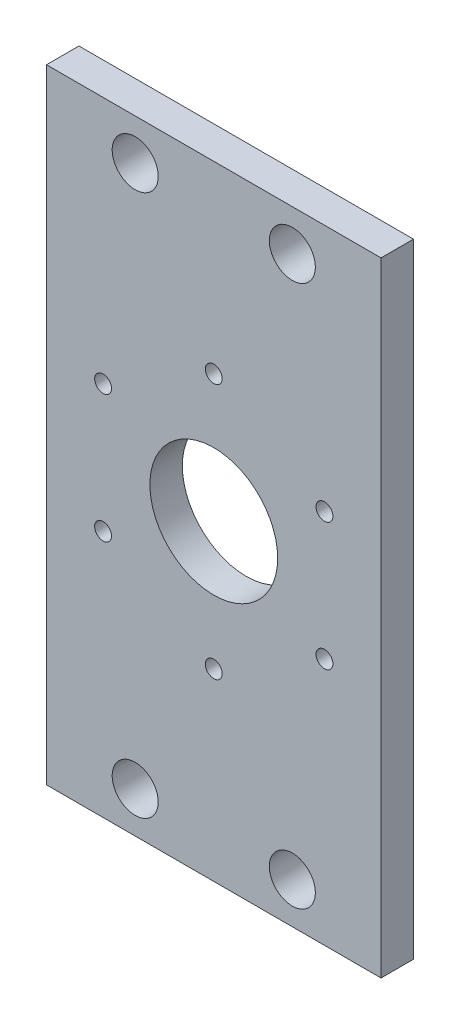
ISO-10303-21;
HEADER;
FILE_DESCRIPTION(('STEP AP214'),'2;1');
FILE_NAME('part.step','',(''),(''),'','','');
FILE_SCHEMA(('AUTOMOTIVE_DESIGN { 1 0 10303 214 1 1 1 1 }'));
ENDSEC;
DATA;
#1=APPLICATION_CONTEXT('core data for automotive mechanical design processes');
#2=APPLICATION_PROTOCOL_DEFINITION('international standard','automotive_design',2000,#1);
#3=PRODUCT_CONTEXT('',#1,'mechanical');
#4=PRODUCT('Part','Part','',(#3));
#5=PRODUCT_RELATED_PRODUCT_CATEGORY('part','',(#4));
#6=PRODUCT_DEFINITION_FORMATION('','',#4);
#7=PRODUCT_DEFINITION_CONTEXT('part definition',#1,'design');
#8=PRODUCT_DEFINITION('design','',#6,#7);
#9=PRODUCT_DEFINITION_SHAPE('','',#8);
#10=(LENGTH_UNIT() NAMED_UNIT(*) SI_UNIT(.MILLI.,.METRE.));
#11=(NAMED_UNIT(*) PLANE_ANGLE_UNIT() SI_UNIT($,.RADIAN.));
#12=(NAMED_UNIT(*) SI_UNIT($,.STERADIAN.) SOLID_ANGLE_UNIT());
#13=UNCERTAINTY_MEASURE_WITH_UNIT(LENGTH_MEASURE(1.E-05),#10,'distance_accuracy_value','');
#14=(GEOMETRIC_REPRESENTATION_CONTEXT(3) GLOBAL_UNCERTAINTY_ASSIGNED_CONTEXT((#13)) GLOBAL_UNIT_ASSIGNED_CONTEXT((#10,
#11,#12)) REPRESENTATION_CONTEXT('',''));
#15=CARTESIAN_POINT('',(0.,0.,0.));
#16=DIRECTION('',(0.,0.,1.));
#17=DIRECTION('',(1.,0.,0.));
#18=AXIS2_PLACEMENT_3D('',#15,#16,#17);
#19=CARTESIAN_POINT('',(0.,0.,6.35));
#20=DIRECTION('',(0.,0.,-1.));
#21=DIRECTION('',(-1.,0.,0.));
#22=AXIS2_PLACEMENT_3D('',#19,#20,#21);
#23=PLANE('',#22);
#24=CARTESIAN_POINT('',(0.,0.,6.35));
#25=DIRECTION('',(0.,0.,1.));
#26=DIRECTION('',(1.,0.,0.));
#27=AXIS2_PLACEMENT_3D('',#24,#25,#26);
#28=CIRCLE('',#27,12.5);
#29=CARTESIAN_POINT('',(12.5,0.,6.35));
#30=VERTEX_POINT('',#29);
#31=EDGE_CURVE('E175',#30,#30,#28,.T.);
#32=ORIENTED_EDGE('',*,*,#31,.F.);
#33=EDGE_LOOP('',(#32));
#34=FACE_BOUND('',#33,.T.);
#35=CARTESIAN_POINT('',(-15.37,53.,6.35));
#36=DIRECTION('',(0.,0.,1.));
#37=DIRECTION('',(1.,0.,0.));
#38=AXIS2_PLACEMENT_3D('',#35,#36,#37);
#39=CIRCLE('',#38,4.5);
#40=CARTESIAN_POINT('',(-10.87,53.,6.35));
#41=VERTEX_POINT('',#40);
#42=EDGE_CURVE('E172',#41,#41,#39,.T.);
#43=ORIENTED_EDGE('',*,*,#42,.F.);
#44=EDGE_LOOP('',(#43));
#45=FACE_BOUND('',#44,.T.);
#46=CARTESIAN_POINT('',(15.37,53.,6.35));
#47=DIRECTION('',(0.,0.,1.));
#48=DIRECTION('',(1.,0.,0.));
#49=AXIS2_PLACEMENT_3D('',#46,#47,#48);
#50=CIRCLE('',#49,4.5);
#51=CARTESIAN_POINT('',(19.87,53.,6.35));
#52=VERTEX_POINT('',#51);
#53=EDGE_CURVE('E166',#52,#52,#50,.T.);
#54=ORIENTED_EDGE('',*,*,#53,.F.);
#55=EDGE_LOOP('',(#54));
#56=FACE_BOUND('',#55,.T.);
#57=CARTESIAN_POINT('',(-15.37,-53.,6.35));
#58=DIRECTION('',(0.,0.,1.));
#59=DIRECTION('',(1.,0.,0.));
#60=AXIS2_PLACEMENT_3D('',#57,#58,#59);
#61=CIRCLE('',#60,4.5);
#62=CARTESIAN_POINT('',(-10.87,-53.,6.35));
#63=VERTEX_POINT('',#62);
#64=EDGE_CURVE('E154',#63,#63,#61,.T.);
#65=ORIENTED_EDGE('',*,*,#64,.F.);
#66=EDGE_LOOP('',(#65));
#67=FACE_BOUND('',#66,.T.);
#68=CARTESIAN_POINT('',(0.,25.,6.35));
#69=DIRECTION('',(0.,0.,1.));
#70=DIRECTION('',(1.,0.,0.));
#71=AXIS2_PLACEMENT_3D('',#68,#69,#70);
#72=CIRCLE('',#71,1.64999999999999);
#73=CARTESIAN_POINT('',(1.64999999999999,25.,6.35));
#74=VERTEX_POINT('',#73);
#75=EDGE_CURVE('E148',#74,#74,#72,.T.);
#76=ORIENTED_EDGE('',*,*,#75,.F.);
#77=EDGE_LOOP('',(#76));
#78=FACE_BOUND('',#77,.T.);
#79=CARTESIAN_POINT('',(0.,-25.,6.35));
#80=DIRECTION('',(0.,0.,1.));
#81=DIRECTION('',(1.,0.,0.));
#82=AXIS2_PLACEMENT_3D('',#79,#80,#81);
#83=CIRCLE('',#82,1.64999999999999);
#84=CARTESIAN_POINT('',(1.64999999999999,-25.,6.35));
#85=VERTEX_POINT('',#84);
#86=EDGE_CURVE('E130',#85,#85,#83,.T.);
#87=ORIENTED_EDGE('',*,*,#86,.F.);
#88=EDGE_LOOP('',(#87));
#89=FACE_BOUND('',#88,.T.);
#90=CARTESIAN_POINT('',(21.650635094611,-12.5,6.35));
#91=DIRECTION('',(0.,0.,1.));
#92=DIRECTION('',(1.,0.,0.));
#93=AXIS2_PLACEMENT_3D('',#90,#91,#92);
#94=CIRCLE('',#93,1.64999999999999);
#95=CARTESIAN_POINT('',(23.300635094611,-12.5,6.35));
#96=VERTEX_POINT('',#95);
#97=EDGE_CURVE('E124',#96,#96,#94,.T.);
#98=ORIENTED_EDGE('',*,*,#97,.F.);
#99=EDGE_LOOP('',(#98));
#100=FACE_BOUND('',#99,.T.);
#101=CARTESIAN_POINT('',(21.650635094611,12.5,6.35));
#102=DIRECTION('',(0.,0.,1.));
#103=DIRECTION('',(1.,0.,0.));
#104=AXIS2_PLACEMENT_3D('',#101,#102,#103);
#105=CIRCLE('',#104,1.64999999999999);
#106=CARTESIAN_POINT('',(23.3006350946109,12.5,6.35));
#107=VERTEX_POINT('',#106);
#108=EDGE_CURVE('E118',#107,#107,#105,.T.);
#109=ORIENTED_EDGE('',*,*,#108,.F.);
#110=EDGE_LOOP('',(#109));
#111=FACE_BOUND('',#110,.T.);
#112=DIRECTION('',(0.,1.,0.));
#113=VECTOR('',#112,1.);
#114=CARTESIAN_POINT('',(32.72,-61.,6.35));
#115=LINE('',#114,#113);
#116=CARTESIAN_POINT('',(32.72,-61.,6.35));
#117=VERTEX_POINT('',#116);
#118=CARTESIAN_POINT('',(32.72,61.,6.35));
#119=VERTEX_POINT('',#118);
#120=EDGE_CURVE('E90',#117,#119,#115,.T.);
#121=ORIENTED_EDGE('',*,*,#120,.T.);
#122=DIRECTION('',(-1.,0.,0.));
#123=VECTOR('',#122,1.);
#124=CARTESIAN_POINT('',(-32.72,61.,6.35));
#125=LINE('',#124,#123);
#126=CARTESIAN_POINT('',(-32.72,61.,6.35));
#127=VERTEX_POINT('',#126);
#128=EDGE_CURVE('E85',#119,#127,#125,.T.);
#129=ORIENTED_EDGE('',*,*,#128,.T.);
#130=DIRECTION('',(0.,-1.,0.));
#131=VECTOR('',#130,1.);
#132=CARTESIAN_POINT('',(-32.72,-61.,6.35));
#133=LINE('',#132,#131);
#134=CARTESIAN_POINT('',(-32.72,-61.,6.35));
#135=VERTEX_POINT('',#134);
#136=EDGE_CURVE('E88',#127,#135,#133,.T.);
#137=ORIENTED_EDGE('',*,*,#136,.T.);
#138=DIRECTION('',(1.,0.,0.));
#139=VECTOR('',#138,1.);
#140=CARTESIAN_POINT('',(-32.72,-61.,6.35));
#141=LINE('',#140,#139);
#142=EDGE_CURVE('E55',#135,#117,#141,.T.);
#143=ORIENTED_EDGE('',*,*,#142,.T.);
#144=EDGE_LOOP('',(#121,#129,#137,#143));
#145=FACE_BOUND('',#144,.T.);
#146=CARTESIAN_POINT('',(-21.650635094611,-12.5,6.35));
#147=DIRECTION('',(0.,0.,1.));
#148=DIRECTION('',(1.,0.,0.));
#149=AXIS2_PLACEMENT_3D('',#146,#147,#148);
#150=CIRCLE('',#149,1.64999999999999);
#151=CARTESIAN_POINT('',(-20.000635094611,-12.5,6.35));
#152=VERTEX_POINT('',#151);
#153=EDGE_CURVE('E136',#152,#152,#150,.T.);
#154=ORIENTED_EDGE('',*,*,#153,.F.);
#155=EDGE_LOOP('',(#154));
#156=FACE_BOUND('',#155,.T.);
#157=CARTESIAN_POINT('',(-21.650635094611,12.5,6.35));
#158=DIRECTION('',(0.,0.,1.));
#159=DIRECTION('',(1.,0.,0.));
#160=AXIS2_PLACEMENT_3D('',#157,#158,#159);
#161=CIRCLE('',#160,1.64999999999999);
#162=CARTESIAN_POINT('',(-20.000635094611,12.5,6.35));
#163=VERTEX_POINT('',#162);
#164=EDGE_CURVE('E142',#163,#163,#161,.T.);
#165=ORIENTED_EDGE('',*,*,#164,.F.);
#166=EDGE_LOOP('',(#165));
#167=FACE_BOUND('',#166,.T.);
#168=CARTESIAN_POINT('',(15.37,-53.,6.35));
#169=DIRECTION('',(0.,0.,1.));
#170=DIRECTION('',(1.,0.,0.));
#171=AXIS2_PLACEMENT_3D('',#168,#169,#170);
#172=CIRCLE('',#171,4.5);
#173=CARTESIAN_POINT('',(19.87,-53.,6.35));
#174=VERTEX_POINT('',#173);
#175=EDGE_CURVE('E160',#174,#174,#172,.T.);
#176=ORIENTED_EDGE('',*,*,#175,.F.);
#177=EDGE_LOOP('',(#176));
#178=FACE_BOUND('',#177,.T.);
#179=ADVANCED_FACE('F38',(#34,#45,#56,#67,#78,#89,#100,#111,#145,#156,#167,#178),#23,.F.);
#180=CARTESIAN_POINT('',(32.72,-61.,6.35));
#181=DIRECTION('',(-1.,0.,0.));
#182=DIRECTION('',(0.,0.,1.));
#183=AXIS2_PLACEMENT_3D('',#180,#181,#182);
#184=PLANE('',#183);
#185=DIRECTION('',(0.,1.,0.));
#186=VECTOR('',#185,1.);
#187=CARTESIAN_POINT('',(32.72,-61.,0.));
#188=LINE('',#187,#186);
#189=CARTESIAN_POINT('',(32.72,-61.,0.));
#190=VERTEX_POINT('',#189);
#191=CARTESIAN_POINT('',(32.72,61.,0.));
#192=VERTEX_POINT('',#191);
#193=EDGE_CURVE('E102',#190,#192,#188,.T.);
#194=ORIENTED_EDGE('',*,*,#193,.T.);
#195=DIRECTION('',(0.,0.,-1.));
#196=VECTOR('',#195,1.);
#197=CARTESIAN_POINT('',(32.72,61.,6.35));
#198=LINE('',#197,#196);
#199=EDGE_CURVE('E11',#119,#192,#198,.T.);
#200=ORIENTED_EDGE('',*,*,#199,.F.);
#201=ORIENTED_EDGE('',*,*,#120,.F.);
#202=DIRECTION('',(0.,0.,-1.));
#203=VECTOR('',#202,1.);
#204=CARTESIAN_POINT('',(32.72,-61.,6.35));
#205=LINE('',#204,#203);
#206=EDGE_CURVE('E98',#117,#190,#205,.T.);
#207=ORIENTED_EDGE('',*,*,#206,.T.);
#208=EDGE_LOOP('',(#194,#200,#201,#207));
#209=FACE_BOUND('',#208,.T.);
#210=ADVANCED_FACE('F40',(#209),#184,.F.);
#211=CARTESIAN_POINT('',(-32.72,61.,6.35));
#212=DIRECTION('',(0.,-1.,0.));
#213=DIRECTION('',(0.,0.,-1.));
#214=AXIS2_PLACEMENT_3D('',#211,#212,#213);
#215=PLANE('',#214);
#216=DIRECTION('',(-1.,0.,0.));
#217=VECTOR('',#216,1.);
#218=CARTESIAN_POINT('',(-32.72,61.,0.));
#219=LINE('',#218,#217);
#220=CARTESIAN_POINT('',(-32.72,61.,0.));
#221=VERTEX_POINT('',#220);
#222=EDGE_CURVE('E94',#192,#221,#219,.T.);
#223=ORIENTED_EDGE('',*,*,#222,.T.);
#224=DIRECTION('',(0.,0.,-1.));
#225=VECTOR('',#224,1.);
#226=CARTESIAN_POINT('',(-32.72,61.,6.35));
#227=LINE('',#226,#225);
#228=EDGE_CURVE('E47',#127,#221,#227,.T.);
#229=ORIENTED_EDGE('',*,*,#228,.F.);
#230=ORIENTED_EDGE('',*,*,#128,.F.);
#231=ORIENTED_EDGE('',*,*,#199,.T.);
#232=EDGE_LOOP('',(#223,#229,#230,#231));
#233=FACE_BOUND('',#232,.T.);
#234=ADVANCED_FACE('F93',(#233),#215,.F.);
#235=CARTESIAN_POINT('',(-32.72,-61.,6.35));
#236=DIRECTION('',(1.,0.,0.));
#237=DIRECTION('',(0.,0.,-1.));
#238=AXIS2_PLACEMENT_3D('',#235,#236,#237);
#239=PLANE('',#238);
#240=DIRECTION('',(0.,-1.,0.));
#241=VECTOR('',#240,1.);
#242=CARTESIAN_POINT('',(-32.72,-61.,0.));
#243=LINE('',#242,#241);
#244=CARTESIAN_POINT('',(-32.72,-61.,0.));
#245=VERTEX_POINT('',#244);
#246=EDGE_CURVE('E72',#221,#245,#243,.T.);
#247=ORIENTED_EDGE('',*,*,#246,.T.);
#248=DIRECTION('',(0.,0.,-1.));
#249=VECTOR('',#248,1.);
#250=CARTESIAN_POINT('',(-32.72,-61.,6.35));
#251=LINE('',#250,#249);
#252=EDGE_CURVE('E95',#135,#245,#251,.T.);
#253=ORIENTED_EDGE('',*,*,#252,.F.);
#254=ORIENTED_EDGE('',*,*,#136,.F.);
#255=ORIENTED_EDGE('',*,*,#228,.T.);
#256=EDGE_LOOP('',(#247,#253,#254,#255));
#257=FACE_BOUND('',#256,.T.);
#258=ADVANCED_FACE('F96',(#257),#239,.F.);
#259=CARTESIAN_POINT('',(-32.72,-61.,6.35));
#260=DIRECTION('',(0.,1.,0.));
#261=DIRECTION('',(0.,0.,1.));
#262=AXIS2_PLACEMENT_3D('',#259,#260,#261);
#263=PLANE('',#262);
#264=DIRECTION('',(1.,0.,0.));
#265=VECTOR('',#264,1.);
#266=CARTESIAN_POINT('',(-32.72,-61.,0.));
#267=LINE('',#266,#265);
#268=EDGE_CURVE('E78',#245,#190,#267,.T.);
#269=ORIENTED_EDGE('',*,*,#268,.T.);
#270=ORIENTED_EDGE('',*,*,#206,.F.);
#271=ORIENTED_EDGE('',*,*,#142,.F.);
#272=ORIENTED_EDGE('',*,*,#252,.T.);
#273=EDGE_LOOP('',(#269,#270,#271,#272));
#274=FACE_BOUND('',#273,.T.);
#275=ADVANCED_FACE('F110',(#274),#263,.F.);
#276=CARTESIAN_POINT('',(0.,0.,0.));
#277=DIRECTION('',(0.,0.,-1.));
#278=DIRECTION('',(-1.,0.,0.));
#279=AXIS2_PLACEMENT_3D('',#276,#277,#278);
#280=PLANE('',#279);
#281=CARTESIAN_POINT('',(0.,0.,0.));
#282=DIRECTION('',(0.,0.,-1.));
#283=DIRECTION('',(-1.,0.,0.));
#284=AXIS2_PLACEMENT_3D('',#281,#282,#283);
#285=CIRCLE('',#284,12.5);
#286=CARTESIAN_POINT('',(-12.5,0.,0.));
#287=VERTEX_POINT('',#286);
#288=EDGE_CURVE('E176',#287,#287,#285,.F.);
#289=ORIENTED_EDGE('',*,*,#288,.T.);
#290=EDGE_LOOP('',(#289));
#291=FACE_BOUND('',#290,.T.);
#292=CARTESIAN_POINT('',(-15.37,53.,0.));
#293=DIRECTION('',(0.,0.,-1.));
#294=DIRECTION('',(-1.,0.,0.));
#295=AXIS2_PLACEMENT_3D('',#292,#293,#294);
#296=CIRCLE('',#295,4.5);
#297=CARTESIAN_POINT('',(-19.87,53.,0.));
#298=VERTEX_POINT('',#297);
#299=EDGE_CURVE('E169',#298,#298,#296,.T.);
#300=ORIENTED_EDGE('',*,*,#299,.F.);
#301=EDGE_LOOP('',(#300));
#302=FACE_BOUND('',#301,.T.);
#303=CARTESIAN_POINT('',(15.37,53.,0.));
#304=DIRECTION('',(0.,0.,-1.));
#305=DIRECTION('',(-1.,0.,0.));
#306=AXIS2_PLACEMENT_3D('',#303,#304,#305);
#307=CIRCLE('',#306,4.5);
#308=CARTESIAN_POINT('',(10.87,53.,0.));
#309=VERTEX_POINT('',#308);
#310=EDGE_CURVE('E163',#309,#309,#307,.T.);
#311=ORIENTED_EDGE('',*,*,#310,.F.);
#312=EDGE_LOOP('',(#311));
#313=FACE_BOUND('',#312,.T.);
#314=CARTESIAN_POINT('',(15.37,-53.,0.));
#315=DIRECTION('',(0.,0.,-1.));
#316=DIRECTION('',(-1.,0.,0.));
#317=AXIS2_PLACEMENT_3D('',#314,#315,#316);
#318=CIRCLE('',#317,4.5);
#319=CARTESIAN_POINT('',(10.87,-53.,0.));
#320=VERTEX_POINT('',#319);
#321=EDGE_CURVE('E157',#320,#320,#318,.T.);
#322=ORIENTED_EDGE('',*,*,#321,.F.);
#323=EDGE_LOOP('',(#322));
#324=FACE_BOUND('',#323,.T.);
#325=CARTESIAN_POINT('',(-15.37,-53.,0.));
#326=DIRECTION('',(0.,0.,-1.));
#327=DIRECTION('',(-1.,0.,0.));
#328=AXIS2_PLACEMENT_3D('',#325,#326,#327);
#329=CIRCLE('',#328,4.5);
#330=CARTESIAN_POINT('',(-19.87,-53.,0.));
#331=VERTEX_POINT('',#330);
#332=EDGE_CURVE('E151',#331,#331,#329,.T.);
#333=ORIENTED_EDGE('',*,*,#332,.F.);
#334=EDGE_LOOP('',(#333));
#335=FACE_BOUND('',#334,.T.);
#336=CARTESIAN_POINT('',(0.,25.,0.));
#337=DIRECTION('',(0.,0.,-1.));
#338=DIRECTION('',(-1.,0.,0.));
#339=AXIS2_PLACEMENT_3D('',#336,#337,#338);
#340=CIRCLE('',#339,1.64999999999999);
#341=CARTESIAN_POINT('',(-1.64999999999999,25.,0.));
#342=VERTEX_POINT('',#341);
#343=EDGE_CURVE('E145',#342,#342,#340,.T.);
#344=ORIENTED_EDGE('',*,*,#343,.F.);
#345=EDGE_LOOP('',(#344));
#346=FACE_BOUND('',#345,.T.);
#347=CARTESIAN_POINT('',(-21.650635094611,12.5,0.));
#348=DIRECTION('',(0.,0.,-1.));
#349=DIRECTION('',(-1.,0.,0.));
#350=AXIS2_PLACEMENT_3D('',#347,#348,#349);
#351=CIRCLE('',#350,1.64999999999999);
#352=CARTESIAN_POINT('',(-23.3006350946109,12.5,0.));
#353=VERTEX_POINT('',#352);
#354=EDGE_CURVE('E139',#353,#353,#351,.T.);
#355=ORIENTED_EDGE('',*,*,#354,.F.);
#356=EDGE_LOOP('',(#355));
#357=FACE_BOUND('',#356,.T.);
#358=CARTESIAN_POINT('',(-21.650635094611,-12.5,0.));
#359=DIRECTION('',(0.,0.,-1.));
#360=DIRECTION('',(-1.,0.,0.));
#361=AXIS2_PLACEMENT_3D('',#358,#359,#360);
#362=CIRCLE('',#361,1.64999999999999);
#363=CARTESIAN_POINT('',(-23.300635094611,-12.5,0.));
#364=VERTEX_POINT('',#363);
#365=EDGE_CURVE('E133',#364,#364,#362,.T.);
#366=ORIENTED_EDGE('',*,*,#365,.F.);
#367=EDGE_LOOP('',(#366));
#368=FACE_BOUND('',#367,.T.);
#369=CARTESIAN_POINT('',(0.,-25.,0.));
#370=DIRECTION('',(0.,0.,-1.));
#371=DIRECTION('',(-1.,0.,0.));
#372=AXIS2_PLACEMENT_3D('',#369,#370,#371);
#373=CIRCLE('',#372,1.64999999999999);
#374=CARTESIAN_POINT('',(-1.64999999999999,-25.,0.));
#375=VERTEX_POINT('',#374);
#376=EDGE_CURVE('E127',#375,#375,#373,.T.);
#377=ORIENTED_EDGE('',*,*,#376,.F.);
#378=EDGE_LOOP('',(#377));
#379=FACE_BOUND('',#378,.T.);
#380=CARTESIAN_POINT('',(21.650635094611,-12.5,0.));
#381=DIRECTION('',(0.,0.,-1.));
#382=DIRECTION('',(-1.,0.,0.));
#383=AXIS2_PLACEMENT_3D('',#380,#381,#382);
#384=CIRCLE('',#383,1.64999999999999);
#385=CARTESIAN_POINT('',(20.000635094611,-12.5,0.));
#386=VERTEX_POINT('',#385);
#387=EDGE_CURVE('E121',#386,#386,#384,.T.);
#388=ORIENTED_EDGE('',*,*,#387,.F.);
#389=EDGE_LOOP('',(#388));
#390=FACE_BOUND('',#389,.T.);
#391=CARTESIAN_POINT('',(21.650635094611,12.5,0.));
#392=DIRECTION('',(0.,0.,-1.));
#393=DIRECTION('',(-1.,0.,0.));
#394=AXIS2_PLACEMENT_3D('',#391,#392,#393);
#395=CIRCLE('',#394,1.64999999999999);
#396=CARTESIAN_POINT('',(20.000635094611,12.5,0.));
#397=VERTEX_POINT('',#396);
#398=EDGE_CURVE('E105',#397,#397,#395,.T.);
#399=ORIENTED_EDGE('',*,*,#398,.F.);
#400=EDGE_LOOP('',(#399));
#401=FACE_BOUND('',#400,.T.);
#402=ORIENTED_EDGE('',*,*,#193,.F.);
#403=ORIENTED_EDGE('',*,*,#268,.F.);
#404=ORIENTED_EDGE('',*,*,#246,.F.);
#405=ORIENTED_EDGE('',*,*,#222,.F.);
#406=EDGE_LOOP('',(#402,#403,#404,#405));
#407=FACE_BOUND('',#406,.T.);
#408=ADVANCED_FACE('F113',(#291,#302,#313,#324,#335,#346,#357,#368,#379,#390,#401,#407),#280,.T.);
#409=CARTESIAN_POINT('',(21.650635094611,12.5,6.35));
#410=DIRECTION('',(0.,0.,1.));
#411=DIRECTION('',(1.,0.,0.));
#412=AXIS2_PLACEMENT_3D('',#409,#410,#411);
#413=CYLINDRICAL_SURFACE('',#412,1.64999999999999);
#414=ORIENTED_EDGE('',*,*,#108,.T.);
#415=EDGE_LOOP('',(#414));
#416=FACE_BOUND('',#415,.T.);
#417=ORIENTED_EDGE('',*,*,#398,.T.);
#418=EDGE_LOOP('',(#417));
#419=FACE_BOUND('',#418,.T.);
#420=ADVANCED_FACE('F201',(#416,#419),#413,.F.);
#421=CARTESIAN_POINT('',(21.650635094611,-12.5,6.35));
#422=DIRECTION('',(0.,0.,1.));
#423=DIRECTION('',(1.,0.,0.));
#424=AXIS2_PLACEMENT_3D('',#421,#422,#423);
#425=CYLINDRICAL_SURFACE('',#424,1.64999999999999);
#426=ORIENTED_EDGE('',*,*,#97,.T.);
#427=EDGE_LOOP('',(#426));
#428=FACE_BOUND('',#427,.T.);
#429=ORIENTED_EDGE('',*,*,#387,.T.);
#430=EDGE_LOOP('',(#429));
#431=FACE_BOUND('',#430,.T.);
#432=ADVANCED_FACE('F204',(#428,#431),#425,.F.);
#433=CARTESIAN_POINT('',(0.,-25.,6.35));
#434=DIRECTION('',(0.,0.,1.));
#435=DIRECTION('',(1.,0.,0.));
#436=AXIS2_PLACEMENT_3D('',#433,#434,#435);
#437=CYLINDRICAL_SURFACE('',#436,1.64999999999999);
#438=ORIENTED_EDGE('',*,*,#86,.T.);
#439=EDGE_LOOP('',(#438));
#440=FACE_BOUND('',#439,.T.);
#441=ORIENTED_EDGE('',*,*,#376,.T.);
#442=EDGE_LOOP('',(#441));
#443=FACE_BOUND('',#442,.T.);
#444=ADVANCED_FACE('F302',(#440,#443),#437,.F.);
#445=CARTESIAN_POINT('',(-21.650635094611,-12.5,6.35));
#446=DIRECTION('',(0.,0.,1.));
#447=DIRECTION('',(1.,0.,0.));
#448=AXIS2_PLACEMENT_3D('',#445,#446,#447);
#449=CYLINDRICAL_SURFACE('',#448,1.64999999999999);
#450=ORIENTED_EDGE('',*,*,#153,.T.);
#451=EDGE_LOOP('',(#450));
#452=FACE_BOUND('',#451,.T.);
#453=ORIENTED_EDGE('',*,*,#365,.T.);
#454=EDGE_LOOP('',(#453));
#455=FACE_BOUND('',#454,.T.);
#456=ADVANCED_FACE('F294',(#452,#455),#449,.F.);
#457=CARTESIAN_POINT('',(-21.650635094611,12.5,6.35));
#458=DIRECTION('',(0.,0.,1.));
#459=DIRECTION('',(1.,0.,0.));
#460=AXIS2_PLACEMENT_3D('',#457,#458,#459);
#461=CYLINDRICAL_SURFACE('',#460,1.64999999999999);
#462=ORIENTED_EDGE('',*,*,#164,.T.);
#463=EDGE_LOOP('',(#462));
#464=FACE_BOUND('',#463,.T.);
#465=ORIENTED_EDGE('',*,*,#354,.T.);
#466=EDGE_LOOP('',(#465));
#467=FACE_BOUND('',#466,.T.);
#468=ADVANCED_FACE('F285',(#464,#467),#461,.F.);
#469=CARTESIAN_POINT('',(0.,25.,6.35));
#470=DIRECTION('',(0.,0.,1.));
#471=DIRECTION('',(1.,0.,0.));
#472=AXIS2_PLACEMENT_3D('',#469,#470,#471);
#473=CYLINDRICAL_SURFACE('',#472,1.64999999999999);
#474=ORIENTED_EDGE('',*,*,#75,.T.);
#475=EDGE_LOOP('',(#474));
#476=FACE_BOUND('',#475,.T.);
#477=ORIENTED_EDGE('',*,*,#343,.T.);
#478=EDGE_LOOP('',(#477));
#479=FACE_BOUND('',#478,.T.);
#480=ADVANCED_FACE('F276',(#476,#479),#473,.F.);
#481=CARTESIAN_POINT('',(-15.37,-53.,6.35));
#482=DIRECTION('',(0.,0.,1.));
#483=DIRECTION('',(1.,0.,0.));
#484=AXIS2_PLACEMENT_3D('',#481,#482,#483);
#485=CYLINDRICAL_SURFACE('',#484,4.5);
#486=ORIENTED_EDGE('',*,*,#64,.T.);
#487=EDGE_LOOP('',(#486));
#488=FACE_BOUND('',#487,.T.);
#489=ORIENTED_EDGE('',*,*,#332,.T.);
#490=EDGE_LOOP('',(#489));
#491=FACE_BOUND('',#490,.T.);
#492=ADVANCED_FACE('F268',(#488,#491),#485,.F.);
#493=CARTESIAN_POINT('',(15.37,-53.,6.35));
#494=DIRECTION('',(0.,0.,1.));
#495=DIRECTION('',(1.,0.,0.));
#496=AXIS2_PLACEMENT_3D('',#493,#494,#495);
#497=CYLINDRICAL_SURFACE('',#496,4.5);
#498=ORIENTED_EDGE('',*,*,#175,.T.);
#499=EDGE_LOOP('',(#498));
#500=FACE_BOUND('',#499,.T.);
#501=ORIENTED_EDGE('',*,*,#321,.T.);
#502=EDGE_LOOP('',(#501));
#503=FACE_BOUND('',#502,.T.);
#504=ADVANCED_FACE('F260',(#500,#503),#497,.F.);
#505=CARTESIAN_POINT('',(15.37,53.,6.35));
#506=DIRECTION('',(0.,0.,1.));
#507=DIRECTION('',(1.,0.,0.));
#508=AXIS2_PLACEMENT_3D('',#505,#506,#507);
#509=CYLINDRICAL_SURFACE('',#508,4.5);
#510=ORIENTED_EDGE('',*,*,#53,.T.);
#511=EDGE_LOOP('',(#510));
#512=FACE_BOUND('',#511,.T.);
#513=ORIENTED_EDGE('',*,*,#310,.T.);
#514=EDGE_LOOP('',(#513));
#515=FACE_BOUND('',#514,.T.);
#516=ADVANCED_FACE('F255',(#512,#515),#509,.F.);
#517=CARTESIAN_POINT('',(-15.37,53.,6.35));
#518=DIRECTION('',(0.,0.,1.));
#519=DIRECTION('',(1.,0.,0.));
#520=AXIS2_PLACEMENT_3D('',#517,#518,#519);
#521=CYLINDRICAL_SURFACE('',#520,4.5);
#522=ORIENTED_EDGE('',*,*,#42,.T.);
#523=EDGE_LOOP('',(#522));
#524=FACE_BOUND('',#523,.T.);
#525=ORIENTED_EDGE('',*,*,#299,.T.);
#526=EDGE_LOOP('',(#525));
#527=FACE_BOUND('',#526,.T.);
#528=ADVANCED_FACE('F233',(#524,#527),#521,.F.);
#529=CARTESIAN_POINT('',(0.,0.,-0.00100000000000013));
#530=DIRECTION('',(0.,0.,1.));
#531=DIRECTION('',(1.,0.,0.));
#532=AXIS2_PLACEMENT_3D('',#529,#530,#531);
#533=CYLINDRICAL_SURFACE('',#532,12.5);
#534=ORIENTED_EDGE('',*,*,#288,.F.);
#535=EDGE_LOOP('',(#534));
#536=FACE_BOUND('',#535,.T.);
#537=ORIENTED_EDGE('',*,*,#31,.T.);
#538=EDGE_LOOP('',(#537));
#539=FACE_BOUND('',#538,.T.);
#540=ADVANCED_FACE('F182',(#536,#539),#533,.F.);
#541=CLOSED_SHELL('',(#179,#210,#234,#258,#275,#408,#420,#432,#444,#456,#468,#480,#492,#504,
#516,#528,#540));
#542=MANIFOLD_SOLID_BREP('B2',#541);
#543=ADVANCED_BREP_SHAPE_REPRESENTATION('',(#18,#542),#14);
#544=SHAPE_DEFINITION_REPRESENTATION(#9,#543);
ENDSEC;
END-ISO-10303-21;
